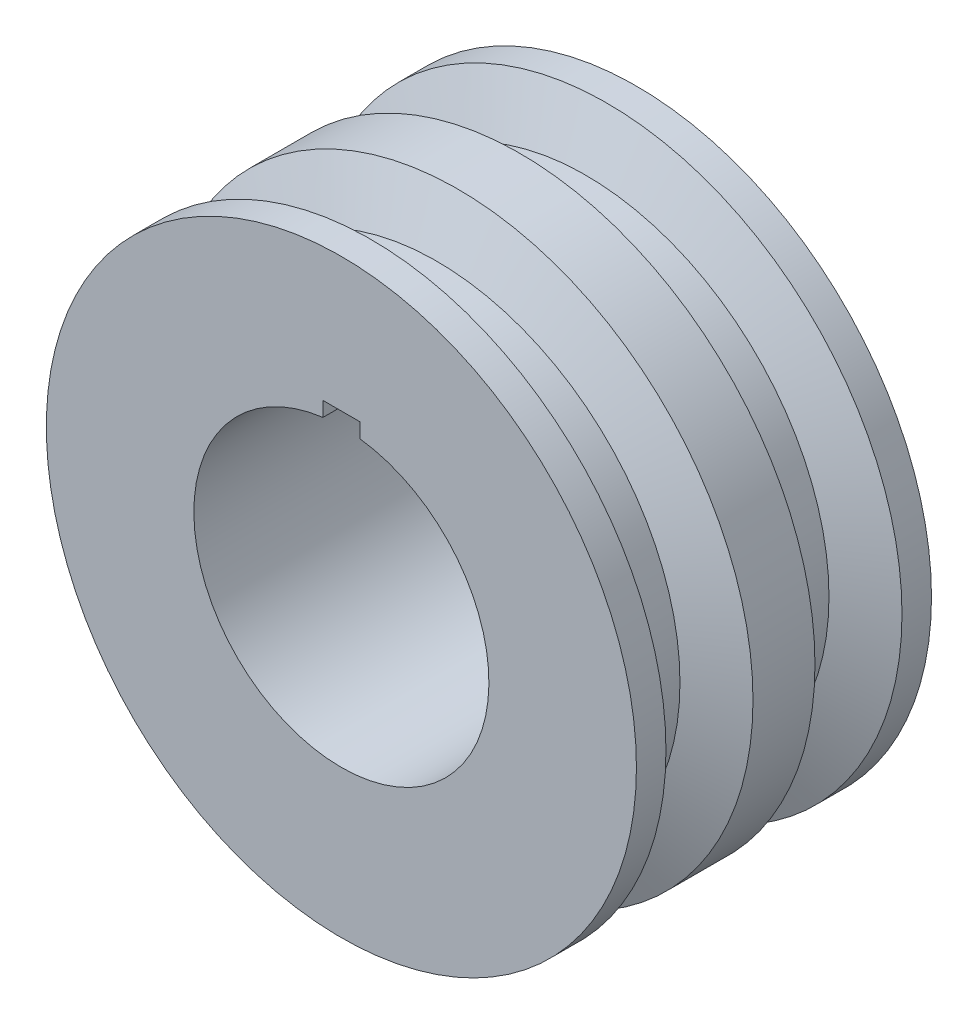
ISO-10303-21;
HEADER;
FILE_DESCRIPTION(('STEP AP214'),'2;1');
FILE_NAME('part.step','',(''),(''),'','','');
FILE_SCHEMA(('AUTOMOTIVE_DESIGN { 1 0 10303 214 1 1 1 1 }'));
ENDSEC;
DATA;
#1=APPLICATION_CONTEXT('core data for automotive mechanical design processes');
#2=APPLICATION_PROTOCOL_DEFINITION('international standard','automotive_design',2000,#1);
#3=PRODUCT_CONTEXT('',#1,'mechanical');
#4=PRODUCT('Part','Part','',(#3));
#5=PRODUCT_RELATED_PRODUCT_CATEGORY('part','',(#4));
#6=PRODUCT_DEFINITION_FORMATION('','',#4);
#7=PRODUCT_DEFINITION_CONTEXT('part definition',#1,'design');
#8=PRODUCT_DEFINITION('design','',#6,#7);
#9=PRODUCT_DEFINITION_SHAPE('','',#8);
#10=(LENGTH_UNIT() NAMED_UNIT(*) SI_UNIT(.MILLI.,.METRE.));
#11=(NAMED_UNIT(*) PLANE_ANGLE_UNIT() SI_UNIT($,.RADIAN.));
#12=(NAMED_UNIT(*) SI_UNIT($,.STERADIAN.) SOLID_ANGLE_UNIT());
#13=UNCERTAINTY_MEASURE_WITH_UNIT(LENGTH_MEASURE(1.E-05),#10,'distance_accuracy_value','');
#14=(GEOMETRIC_REPRESENTATION_CONTEXT(3) GLOBAL_UNCERTAINTY_ASSIGNED_CONTEXT((#13)) GLOBAL_UNIT_ASSIGNED_CONTEXT((#10,
#11,#12)) REPRESENTATION_CONTEXT('',''));
#15=CARTESIAN_POINT('',(0.,0.,0.));
#16=DIRECTION('',(0.,0.,1.));
#17=DIRECTION('',(1.,0.,0.));
#18=AXIS2_PLACEMENT_3D('',#15,#16,#17);
#19=CARTESIAN_POINT('',(0.,0.,40.));
#20=DIRECTION('',(0.,0.,-1.));
#21=DIRECTION('',(-1.,0.,0.));
#22=AXIS2_PLACEMENT_3D('',#19,#20,#21);
#23=CYLINDRICAL_SURFACE('',#22,40.);
#24=CARTESIAN_POINT('',(0.,0.,40.));
#25=DIRECTION('',(0.,0.,1.));
#26=DIRECTION('',(1.,0.,0.));
#27=AXIS2_PLACEMENT_3D('',#24,#25,#26);
#28=CIRCLE('',#27,40.);
#29=CARTESIAN_POINT('',(40.,0.,40.));
#30=VERTEX_POINT('',#29);
#31=EDGE_CURVE('E11',#30,#30,#28,.T.);
#32=ORIENTED_EDGE('',*,*,#31,.F.);
#33=EDGE_LOOP('',(#32));
#34=FACE_BOUND('',#33,.T.);
#35=CARTESIAN_POINT('',(0.,0.,36.));
#36=DIRECTION('',(0.,0.,1.));
#37=DIRECTION('',(1.,0.,0.));
#38=AXIS2_PLACEMENT_3D('',#35,#36,#37);
#39=CIRCLE('',#38,40.);
#40=CARTESIAN_POINT('',(40.,0.,36.));
#41=VERTEX_POINT('',#40);
#42=EDGE_CURVE('E116',#41,#41,#39,.T.);
#43=ORIENTED_EDGE('',*,*,#42,.T.);
#44=EDGE_LOOP('',(#43));
#45=FACE_BOUND('',#44,.T.);
#46=ADVANCED_FACE('F41',(#34,#45),#23,.T.);
#47=CARTESIAN_POINT('',(0.,0.,0.));
#48=DIRECTION('',(0.,0.,1.));
#49=DIRECTION('',(1.,0.,0.));
#50=AXIS2_PLACEMENT_3D('',#47,#48,#49);
#51=CIRCLE('',#50,40.);
#52=CARTESIAN_POINT('',(40.,0.,0.));
#53=VERTEX_POINT('',#52);
#54=EDGE_CURVE('E44',#53,#53,#51,.T.);
#55=ORIENTED_EDGE('',*,*,#54,.T.);
#56=EDGE_LOOP('',(#55));
#57=FACE_BOUND('',#56,.T.);
#58=CARTESIAN_POINT('',(0.,0.,4.));
#59=DIRECTION('',(0.,0.,1.));
#60=DIRECTION('',(1.,0.,0.));
#61=AXIS2_PLACEMENT_3D('',#58,#59,#60);
#62=CIRCLE('',#61,40.);
#63=CARTESIAN_POINT('',(40.,0.,4.));
#64=VERTEX_POINT('',#63);
#65=EDGE_CURVE('E220',#64,#64,#62,.T.);
#66=ORIENTED_EDGE('',*,*,#65,.F.);
#67=EDGE_LOOP('',(#66));
#68=FACE_BOUND('',#67,.T.);
#69=ADVANCED_FACE('F150',(#57,#68),#23,.T.);
#70=CARTESIAN_POINT('',(0.,0.,40.));
#71=DIRECTION('',(0.,0.,1.));
#72=DIRECTION('',(1.,0.,0.));
#73=AXIS2_PLACEMENT_3D('',#70,#71,#72);
#74=PLANE('',#73);
#75=ORIENTED_EDGE('',*,*,#31,.T.);
#76=EDGE_LOOP('',(#75));
#77=FACE_BOUND('',#76,.T.);
#78=DIRECTION('',(0.,1.,0.));
#79=VECTOR('',#78,1.);
#80=CARTESIAN_POINT('',(2.5,21.8431348329844,40.));
#81=LINE('',#80,#79);
#82=CARTESIAN_POINT('',(2.5,19.8431348329844,40.));
#83=VERTEX_POINT('',#82);
#84=CARTESIAN_POINT('',(2.5,21.8431348329844,40.));
#85=VERTEX_POINT('',#84);
#86=EDGE_CURVE('E91',#83,#85,#81,.T.);
#87=ORIENTED_EDGE('',*,*,#86,.F.);
#88=CARTESIAN_POINT('',(0.,0.,40.));
#89=DIRECTION('',(0.,0.,1.));
#90=DIRECTION('',(1.,0.,0.));
#91=AXIS2_PLACEMENT_3D('',#88,#89,#90);
#92=CIRCLE('',#91,20.);
#93=CARTESIAN_POINT('',(-2.5,19.8431348329844,40.));
#94=VERTEX_POINT('',#93);
#95=EDGE_CURVE('E82',#94,#83,#92,.T.);
#96=ORIENTED_EDGE('',*,*,#95,.F.);
#97=DIRECTION('',(0.,-1.,0.));
#98=VECTOR('',#97,1.);
#99=CARTESIAN_POINT('',(-2.5,19.8431348329844,40.));
#100=LINE('',#99,#98);
#101=CARTESIAN_POINT('',(-2.5,21.8431348329844,40.));
#102=VERTEX_POINT('',#101);
#103=EDGE_CURVE('E108',#102,#94,#100,.T.);
#104=ORIENTED_EDGE('',*,*,#103,.F.);
#105=DIRECTION('',(-1.,0.,0.));
#106=VECTOR('',#105,1.);
#107=CARTESIAN_POINT('',(-2.5,21.8431348329844,40.));
#108=LINE('',#107,#106);
#109=EDGE_CURVE('E104',#85,#102,#108,.T.);
#110=ORIENTED_EDGE('',*,*,#109,.F.);
#111=EDGE_LOOP('',(#87,#96,#104,#110));
#112=FACE_BOUND('',#111,.T.);
#113=ADVANCED_FACE('F103',(#77,#112),#74,.T.);
#114=CARTESIAN_POINT('',(0.,0.,0.));
#115=DIRECTION('',(0.,0.,1.));
#116=DIRECTION('',(1.,0.,0.));
#117=AXIS2_PLACEMENT_3D('',#114,#115,#116);
#118=PLANE('',#117);
#119=ORIENTED_EDGE('',*,*,#54,.F.);
#120=EDGE_LOOP('',(#119));
#121=FACE_BOUND('',#120,.T.);
#122=CARTESIAN_POINT('',(0.,0.,0.));
#123=DIRECTION('',(0.,0.,1.));
#124=DIRECTION('',(1.,0.,0.));
#125=AXIS2_PLACEMENT_3D('',#122,#123,#124);
#126=CIRCLE('',#125,20.);
#127=CARTESIAN_POINT('',(-2.5,19.8431348329844,0.));
#128=VERTEX_POINT('',#127);
#129=CARTESIAN_POINT('',(2.5,19.8431348329844,0.));
#130=VERTEX_POINT('',#129);
#131=EDGE_CURVE('E64',#128,#130,#126,.T.);
#132=ORIENTED_EDGE('',*,*,#131,.T.);
#133=DIRECTION('',(0.,1.,0.));
#134=VECTOR('',#133,1.);
#135=CARTESIAN_POINT('',(2.5,21.8431348329844,0.));
#136=LINE('',#135,#134);
#137=CARTESIAN_POINT('',(2.5,21.8431348329844,0.));
#138=VERTEX_POINT('',#137);
#139=EDGE_CURVE('E98',#130,#138,#136,.T.);
#140=ORIENTED_EDGE('',*,*,#139,.T.);
#141=DIRECTION('',(-1.,0.,0.));
#142=VECTOR('',#141,1.);
#143=CARTESIAN_POINT('',(-2.5,21.8431348329844,0.));
#144=LINE('',#143,#142);
#145=CARTESIAN_POINT('',(-2.5,21.8431348329844,0.));
#146=VERTEX_POINT('',#145);
#147=EDGE_CURVE('E119',#138,#146,#144,.T.);
#148=ORIENTED_EDGE('',*,*,#147,.T.);
#149=DIRECTION('',(0.,-1.,0.));
#150=VECTOR('',#149,1.);
#151=CARTESIAN_POINT('',(-2.5,19.8431348329844,0.));
#152=LINE('',#151,#150);
#153=EDGE_CURVE('E92',#146,#128,#152,.T.);
#154=ORIENTED_EDGE('',*,*,#153,.T.);
#155=EDGE_LOOP('',(#132,#140,#148,#154));
#156=FACE_BOUND('',#155,.T.);
#157=ADVANCED_FACE('F135',(#121,#156),#118,.F.);
#158=CARTESIAN_POINT('',(0.,0.,40.));
#159=DIRECTION('',(0.,0.,-1.));
#160=DIRECTION('',(-1.,0.,0.));
#161=AXIS2_PLACEMENT_3D('',#158,#159,#160);
#162=CYLINDRICAL_SURFACE('',#161,20.);
#163=ORIENTED_EDGE('',*,*,#131,.F.);
#164=DIRECTION('',(0.,0.,-1.));
#165=VECTOR('',#164,1.);
#166=CARTESIAN_POINT('',(-2.5,19.8431348329844,40.));
#167=LINE('',#166,#165);
#168=EDGE_CURVE('E86',#94,#128,#167,.T.);
#169=ORIENTED_EDGE('',*,*,#168,.F.);
#170=ORIENTED_EDGE('',*,*,#95,.T.);
#171=DIRECTION('',(0.,0.,-1.));
#172=VECTOR('',#171,1.);
#173=CARTESIAN_POINT('',(2.5,19.8431348329844,40.));
#174=LINE('',#173,#172);
#175=EDGE_CURVE('E85',#83,#130,#174,.T.);
#176=ORIENTED_EDGE('',*,*,#175,.T.);
#177=EDGE_LOOP('',(#163,#169,#170,#176));
#178=FACE_BOUND('',#177,.T.);
#179=ADVANCED_FACE('F84',(#178),#162,.F.);
#180=CARTESIAN_POINT('',(2.5,21.8431348329844,40.));
#181=DIRECTION('',(-1.,0.,0.));
#182=DIRECTION('',(0.,0.,1.));
#183=AXIS2_PLACEMENT_3D('',#180,#181,#182);
#184=PLANE('',#183);
#185=ORIENTED_EDGE('',*,*,#139,.F.);
#186=ORIENTED_EDGE('',*,*,#175,.F.);
#187=ORIENTED_EDGE('',*,*,#86,.T.);
#188=DIRECTION('',(0.,0.,-1.));
#189=VECTOR('',#188,1.);
#190=CARTESIAN_POINT('',(2.5,21.8431348329844,40.));
#191=LINE('',#190,#189);
#192=EDGE_CURVE('E100',#85,#138,#191,.T.);
#193=ORIENTED_EDGE('',*,*,#192,.T.);
#194=EDGE_LOOP('',(#185,#186,#187,#193));
#195=FACE_BOUND('',#194,.T.);
#196=ADVANCED_FACE('F95',(#195),#184,.T.);
#197=CARTESIAN_POINT('',(-2.5,21.8431348329844,40.));
#198=DIRECTION('',(0.,-1.,0.));
#199=DIRECTION('',(0.,0.,-1.));
#200=AXIS2_PLACEMENT_3D('',#197,#198,#199);
#201=PLANE('',#200);
#202=ORIENTED_EDGE('',*,*,#147,.F.);
#203=ORIENTED_EDGE('',*,*,#192,.F.);
#204=ORIENTED_EDGE('',*,*,#109,.T.);
#205=DIRECTION('',(0.,0.,-1.));
#206=VECTOR('',#205,1.);
#207=CARTESIAN_POINT('',(-2.5,21.8431348329844,40.));
#208=LINE('',#207,#206);
#209=EDGE_CURVE('E56',#102,#146,#208,.T.);
#210=ORIENTED_EDGE('',*,*,#209,.T.);
#211=EDGE_LOOP('',(#202,#203,#204,#210));
#212=FACE_BOUND('',#211,.T.);
#213=ADVANCED_FACE('F133',(#212),#201,.T.);
#214=CARTESIAN_POINT('',(-2.5,19.8431348329844,40.));
#215=DIRECTION('',(1.,0.,0.));
#216=DIRECTION('',(0.,0.,-1.));
#217=AXIS2_PLACEMENT_3D('',#214,#215,#216);
#218=PLANE('',#217);
#219=ORIENTED_EDGE('',*,*,#153,.F.);
#220=ORIENTED_EDGE('',*,*,#209,.F.);
#221=ORIENTED_EDGE('',*,*,#103,.T.);
#222=ORIENTED_EDGE('',*,*,#168,.T.);
#223=EDGE_LOOP('',(#219,#220,#221,#222));
#224=FACE_BOUND('',#223,.T.);
#225=ADVANCED_FACE('F136',(#224),#218,.T.);
#226=CARTESIAN_POINT('',(0.,0.,15.7989898732233));
#227=DIRECTION('',(0.,0.,1.));
#228=DIRECTION('',(1.,0.,0.));
#229=AXIS2_PLACEMENT_3D('',#226,#227,#228);
#230=CONICAL_SURFACE('',#229,40.,1.17809724509617);
#231=CARTESIAN_POINT('',(0.,0.,12.8994949366116));
#232=DIRECTION('',(0.,0.,1.));
#233=DIRECTION('',(1.,0.,0.));
#234=AXIS2_PLACEMENT_3D('',#231,#232,#233);
#235=CIRCLE('',#234,33.);
#236=CARTESIAN_POINT('',(33.,0.,12.8994949366116));
#237=VERTEX_POINT('',#236);
#238=EDGE_CURVE('E187',#237,#237,#235,.T.);
#239=ORIENTED_EDGE('',*,*,#238,.T.);
#240=EDGE_LOOP('',(#239));
#241=FACE_BOUND('',#240,.T.);
#242=CARTESIAN_POINT('',(0.,0.,15.7989898732233));
#243=DIRECTION('',(0.,0.,1.));
#244=DIRECTION('',(1.,0.,0.));
#245=AXIS2_PLACEMENT_3D('',#242,#243,#244);
#246=CIRCLE('',#245,40.);
#247=CARTESIAN_POINT('',(40.,0.,15.7989898732233));
#248=VERTEX_POINT('',#247);
#249=EDGE_CURVE('E174',#248,#248,#246,.T.);
#250=ORIENTED_EDGE('',*,*,#249,.F.);
#251=EDGE_LOOP('',(#250));
#252=FACE_BOUND('',#251,.T.);
#253=ADVANCED_FACE('F138',(#241,#252),#230,.T.);
#254=CARTESIAN_POINT('',(0.,0.,40.));
#255=DIRECTION('',(0.,0.,1.));
#256=DIRECTION('',(1.,0.,0.));
#257=AXIS2_PLACEMENT_3D('',#254,#255,#256);
#258=CYLINDRICAL_SURFACE('',#257,33.);
#259=CARTESIAN_POINT('',(0.,0.,6.89949493661164));
#260=DIRECTION('',(0.,0.,1.));
#261=DIRECTION('',(1.,0.,0.));
#262=AXIS2_PLACEMENT_3D('',#259,#260,#261);
#263=CIRCLE('',#262,33.);
#264=CARTESIAN_POINT('',(33.,0.,6.89949493661164));
#265=VERTEX_POINT('',#264);
#266=EDGE_CURVE('E215',#265,#265,#263,.T.);
#267=ORIENTED_EDGE('',*,*,#266,.T.);
#268=EDGE_LOOP('',(#267));
#269=FACE_BOUND('',#268,.T.);
#270=ORIENTED_EDGE('',*,*,#238,.F.);
#271=EDGE_LOOP('',(#270));
#272=FACE_BOUND('',#271,.T.);
#273=ADVANCED_FACE('F144',(#269,#272),#258,.T.);
#274=CARTESIAN_POINT('',(0.,0.,6.89949493661164));
#275=DIRECTION('',(0.,0.,-1.));
#276=DIRECTION('',(-1.,0.,0.));
#277=AXIS2_PLACEMENT_3D('',#274,#275,#276);
#278=CONICAL_SURFACE('',#277,33.,1.17809724509617);
#279=ORIENTED_EDGE('',*,*,#65,.T.);
#280=EDGE_LOOP('',(#279));
#281=FACE_BOUND('',#280,.T.);
#282=ORIENTED_EDGE('',*,*,#266,.F.);
#283=EDGE_LOOP('',(#282));
#284=FACE_BOUND('',#283,.T.);
#285=ADVANCED_FACE('F161',(#281,#284),#278,.T.);
#286=ORIENTED_EDGE('',*,*,#249,.T.);
#287=EDGE_LOOP('',(#286));
#288=FACE_BOUND('',#287,.T.);
#289=CARTESIAN_POINT('',(0.,0.,24.2010101267767));
#290=DIRECTION('',(0.,0.,1.));
#291=DIRECTION('',(1.,0.,0.));
#292=AXIS2_PLACEMENT_3D('',#289,#290,#291);
#293=CIRCLE('',#292,40.);
#294=CARTESIAN_POINT('',(40.,0.,24.2010101267767));
#295=VERTEX_POINT('',#294);
#296=EDGE_CURVE('E177',#295,#295,#293,.T.);
#297=ORIENTED_EDGE('',*,*,#296,.F.);
#298=EDGE_LOOP('',(#297));
#299=FACE_BOUND('',#298,.T.);
#300=ADVANCED_FACE('F152',(#288,#299),#23,.T.);
#301=CARTESIAN_POINT('',(0.,0.,36.));
#302=DIRECTION('',(0.,0.,1.));
#303=DIRECTION('',(1.,0.,0.));
#304=AXIS2_PLACEMENT_3D('',#301,#302,#303);
#305=CONICAL_SURFACE('',#304,40.,1.17809724509617);
#306=CARTESIAN_POINT('',(0.,0.,33.1005050633884));
#307=DIRECTION('',(0.,0.,1.));
#308=DIRECTION('',(1.,0.,0.));
#309=AXIS2_PLACEMENT_3D('',#306,#307,#308);
#310=CIRCLE('',#309,33.);
#311=CARTESIAN_POINT('',(33.,0.,33.1005050633884));
#312=VERTEX_POINT('',#311);
#313=EDGE_CURVE('E185',#312,#312,#310,.T.);
#314=ORIENTED_EDGE('',*,*,#313,.T.);
#315=EDGE_LOOP('',(#314));
#316=FACE_BOUND('',#315,.T.);
#317=ORIENTED_EDGE('',*,*,#42,.F.);
#318=EDGE_LOOP('',(#317));
#319=FACE_BOUND('',#318,.T.);
#320=ADVANCED_FACE('F160',(#316,#319),#305,.T.);
#321=CARTESIAN_POINT('',(0.,0.,40.));
#322=DIRECTION('',(0.,0.,1.));
#323=DIRECTION('',(1.,0.,0.));
#324=AXIS2_PLACEMENT_3D('',#321,#322,#323);
#325=CYLINDRICAL_SURFACE('',#324,33.);
#326=CARTESIAN_POINT('',(0.,0.,27.1005050633884));
#327=DIRECTION('',(0.,0.,1.));
#328=DIRECTION('',(1.,0.,0.));
#329=AXIS2_PLACEMENT_3D('',#326,#327,#328);
#330=CIRCLE('',#329,33.);
#331=CARTESIAN_POINT('',(33.,0.,27.1005050633884));
#332=VERTEX_POINT('',#331);
#333=EDGE_CURVE('E180',#332,#332,#330,.T.);
#334=ORIENTED_EDGE('',*,*,#333,.T.);
#335=EDGE_LOOP('',(#334));
#336=FACE_BOUND('',#335,.T.);
#337=ORIENTED_EDGE('',*,*,#313,.F.);
#338=EDGE_LOOP('',(#337));
#339=FACE_BOUND('',#338,.T.);
#340=ADVANCED_FACE('F167',(#336,#339),#325,.T.);
#341=CARTESIAN_POINT('',(0.,0.,27.1005050633884));
#342=DIRECTION('',(0.,0.,-1.));
#343=DIRECTION('',(-1.,0.,0.));
#344=AXIS2_PLACEMENT_3D('',#341,#342,#343);
#345=CONICAL_SURFACE('',#344,33.,1.17809724509617);
#346=ORIENTED_EDGE('',*,*,#296,.T.);
#347=EDGE_LOOP('',(#346));
#348=FACE_BOUND('',#347,.T.);
#349=ORIENTED_EDGE('',*,*,#333,.F.);
#350=EDGE_LOOP('',(#349));
#351=FACE_BOUND('',#350,.T.);
#352=ADVANCED_FACE('F200',(#348,#351),#345,.T.);
#353=CLOSED_SHELL('',(#46,#69,#113,#157,#179,#196,#213,#225,#253,#273,#285,#300,#320,#340,#352));
#354=MANIFOLD_SOLID_BREP('B2',#353);
#355=ADVANCED_BREP_SHAPE_REPRESENTATION('',(#18,#354),#14);
#356=SHAPE_DEFINITION_REPRESENTATION(#9,#355);
ENDSEC;
END-ISO-10303-21;
